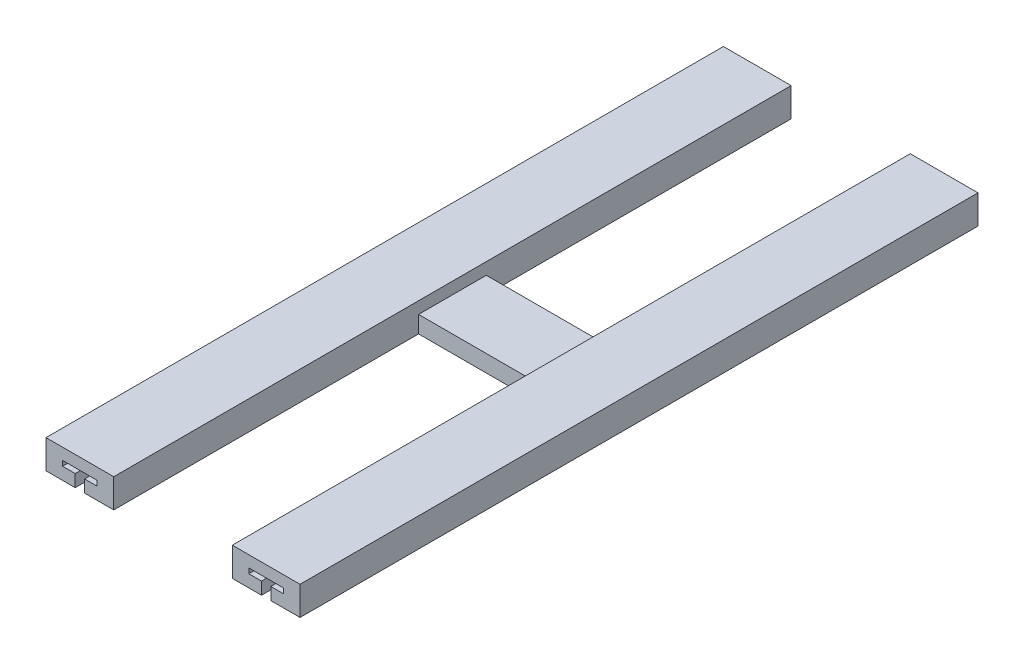
ISO-10303-21;
HEADER;
FILE_DESCRIPTION(('STEP AP214'),'2;1');
FILE_NAME('part.step','',(''),(''),'','','');
FILE_SCHEMA(('AUTOMOTIVE_DESIGN { 1 0 10303 214 1 1 1 1 }'));
ENDSEC;
DATA;
#1=APPLICATION_CONTEXT('core data for automotive mechanical design processes');
#2=APPLICATION_PROTOCOL_DEFINITION('international standard','automotive_design',2000,#1);
#3=PRODUCT_CONTEXT('',#1,'mechanical');
#4=PRODUCT('Part','Part','',(#3));
#5=PRODUCT_RELATED_PRODUCT_CATEGORY('part','',(#4));
#6=PRODUCT_DEFINITION_FORMATION('','',#4);
#7=PRODUCT_DEFINITION_CONTEXT('part definition',#1,'design');
#8=PRODUCT_DEFINITION('design','',#6,#7);
#9=PRODUCT_DEFINITION_SHAPE('','',#8);
#10=(LENGTH_UNIT() NAMED_UNIT(*) SI_UNIT(.MILLI.,.METRE.));
#11=(NAMED_UNIT(*) PLANE_ANGLE_UNIT() SI_UNIT($,.RADIAN.));
#12=(NAMED_UNIT(*) SI_UNIT($,.STERADIAN.) SOLID_ANGLE_UNIT());
#13=UNCERTAINTY_MEASURE_WITH_UNIT(LENGTH_MEASURE(1.E-05),#10,'distance_accuracy_value','');
#14=(GEOMETRIC_REPRESENTATION_CONTEXT(3) GLOBAL_UNCERTAINTY_ASSIGNED_CONTEXT((#13)) GLOBAL_UNIT_ASSIGNED_CONTEXT((#10,
#11,#12)) REPRESENTATION_CONTEXT('',''));
#15=CARTESIAN_POINT('',(0.,0.,0.));
#16=DIRECTION('',(0.,0.,1.));
#17=DIRECTION('',(1.,0.,0.));
#18=AXIS2_PLACEMENT_3D('',#15,#16,#17);
#19=CARTESIAN_POINT('',(0.,0.,0.));
#20=DIRECTION('',(0.,-1.,0.));
#21=DIRECTION('',(0.,0.,-1.));
#22=AXIS2_PLACEMENT_3D('',#19,#20,#21);
#23=PLANE('',#22);
#24=DIRECTION('',(-1.,0.,0.));
#25=VECTOR('',#24,1.);
#26=CARTESIAN_POINT('',(0.,0.,-49.6681439708841));
#27=LINE('',#26,#25);
#28=CARTESIAN_POINT('',(127.25,0.,-49.6681439708841));
#29=VERTEX_POINT('',#28);
#30=CARTESIAN_POINT('',(110.,0.,-49.6681439708841));
#31=VERTEX_POINT('',#30);
#32=EDGE_CURVE('E216',#29,#31,#27,.T.);
#33=ORIENTED_EDGE('',*,*,#32,.T.);
#34=DIRECTION('',(0.,0.,1.));
#35=VECTOR('',#34,1.);
#36=CARTESIAN_POINT('',(110.,0.,-229.668143970884));
#37=LINE('',#36,#35);
#38=CARTESIAN_POINT('',(110.,0.,-229.668143970884));
#39=VERTEX_POINT('',#38);
#40=EDGE_CURVE('E185',#39,#31,#37,.T.);
#41=ORIENTED_EDGE('',*,*,#40,.F.);
#42=DIRECTION('',(1.,0.,0.));
#43=VECTOR('',#42,1.);
#44=CARTESIAN_POINT('',(40.,0.,-229.668143970884));
#45=LINE('',#44,#43);
#46=CARTESIAN_POINT('',(40.,0.,-229.668143970884));
#47=VERTEX_POINT('',#46);
#48=EDGE_CURVE('E182',#47,#39,#45,.T.);
#49=ORIENTED_EDGE('',*,*,#48,.F.);
#50=DIRECTION('',(0.,0.,-1.));
#51=VECTOR('',#50,1.);
#52=CARTESIAN_POINT('',(40.,0.,-229.668143970884));
#53=LINE('',#52,#51);
#54=CARTESIAN_POINT('',(40.0000000000001,0.,-49.6681439708841));
#55=VERTEX_POINT('',#54);
#56=EDGE_CURVE('E173',#55,#47,#53,.T.);
#57=ORIENTED_EDGE('',*,*,#56,.F.);
#58=DIRECTION('',(1.,0.,0.));
#59=VECTOR('',#58,1.);
#60=CARTESIAN_POINT('',(0.,0.,-49.6681439708841));
#61=LINE('',#60,#59);
#62=CARTESIAN_POINT('',(22.75,0.,-49.6681439708841));
#63=VERTEX_POINT('',#62);
#64=EDGE_CURVE('E141',#63,#55,#61,.T.);
#65=ORIENTED_EDGE('',*,*,#64,.F.);
#66=DIRECTION('',(0.,0.,1.));
#67=VECTOR('',#66,1.);
#68=CARTESIAN_POINT('',(22.75,0.,0.));
#69=LINE('',#68,#67);
#70=CARTESIAN_POINT('',(22.75,0.,-449.668143970884));
#71=VERTEX_POINT('',#70);
#72=EDGE_CURVE('E41',#71,#63,#69,.T.);
#73=ORIENTED_EDGE('',*,*,#72,.F.);
#74=DIRECTION('',(-1.,0.,0.));
#75=VECTOR('',#74,1.);
#76=CARTESIAN_POINT('',(0.,0.,-449.668143970884));
#77=LINE('',#76,#75);
#78=CARTESIAN_POINT('',(40.0000000000001,0.,-449.668143970884));
#79=VERTEX_POINT('',#78);
#80=EDGE_CURVE('E177',#79,#71,#77,.T.);
#81=ORIENTED_EDGE('',*,*,#80,.F.);
#82=DIRECTION('',(0.,0.,-1.));
#83=VECTOR('',#82,1.);
#84=CARTESIAN_POINT('',(40.0000000000001,0.,-449.668143970884));
#85=LINE('',#84,#83);
#86=CARTESIAN_POINT('',(40.,0.,-269.668143970884));
#87=VERTEX_POINT('',#86);
#88=EDGE_CURVE('E371',#87,#79,#85,.T.);
#89=ORIENTED_EDGE('',*,*,#88,.F.);
#90=DIRECTION('',(-1.,0.,0.));
#91=VECTOR('',#90,1.);
#92=CARTESIAN_POINT('',(40.,0.,-269.668143970884));
#93=LINE('',#92,#91);
#94=CARTESIAN_POINT('',(110.,0.,-269.668143970884));
#95=VERTEX_POINT('',#94);
#96=EDGE_CURVE('E362',#95,#87,#93,.T.);
#97=ORIENTED_EDGE('',*,*,#96,.F.);
#98=DIRECTION('',(0.,0.,1.));
#99=VECTOR('',#98,1.);
#100=CARTESIAN_POINT('',(110.,0.,-450.));
#101=LINE('',#100,#99);
#102=CARTESIAN_POINT('',(110.,0.,-450.));
#103=VERTEX_POINT('',#102);
#104=EDGE_CURVE('E126',#103,#95,#101,.T.);
#105=ORIENTED_EDGE('',*,*,#104,.F.);
#106=DIRECTION('',(-1.,0.,0.));
#107=VECTOR('',#106,1.);
#108=CARTESIAN_POINT('',(110.,0.,-450.));
#109=LINE('',#108,#107);
#110=CARTESIAN_POINT('',(127.25,0.,-450.));
#111=VERTEX_POINT('',#110);
#112=EDGE_CURVE('E190',#111,#103,#109,.T.);
#113=ORIENTED_EDGE('',*,*,#112,.F.);
#114=DIRECTION('',(0.,0.,1.));
#115=VECTOR('',#114,1.);
#116=CARTESIAN_POINT('',(127.25,0.,-450.));
#117=LINE('',#116,#115);
#118=EDGE_CURVE('E169',#111,#29,#117,.T.);
#119=ORIENTED_EDGE('',*,*,#118,.T.);
#120=EDGE_LOOP('',(#33,#41,#49,#57,#65,#73,#81,#89,#97,#105,#113,#119));
#121=FACE_BOUND('',#120,.T.);
#122=ADVANCED_FACE('F33',(#121),#23,.T.);
#123=CARTESIAN_POINT('',(110.,17.,-450.));
#124=DIRECTION('',(0.,0.,1.));
#125=DIRECTION('',(1.,0.,0.));
#126=AXIS2_PLACEMENT_3D('',#123,#124,#125);
#127=PLANE('',#126);
#128=DIRECTION('',(0.,1.,0.));
#129=VECTOR('',#128,1.);
#130=CARTESIAN_POINT('',(127.25,7.25,-450.));
#131=LINE('',#130,#129);
#132=CARTESIAN_POINT('',(127.25,7.25,-450.));
#133=VERTEX_POINT('',#132);
#134=EDGE_CURVE('E258',#111,#133,#131,.T.);
#135=ORIENTED_EDGE('',*,*,#134,.F.);
#136=ORIENTED_EDGE('',*,*,#112,.T.);
#137=DIRECTION('',(0.,-1.,0.));
#138=VECTOR('',#137,1.);
#139=CARTESIAN_POINT('',(110.,17.,-450.));
#140=LINE('',#139,#138);
#141=CARTESIAN_POINT('',(110.,17.,-450.));
#142=VERTEX_POINT('',#141);
#143=EDGE_CURVE('E196',#142,#103,#140,.T.);
#144=ORIENTED_EDGE('',*,*,#143,.F.);
#145=DIRECTION('',(-1.,0.,0.));
#146=VECTOR('',#145,1.);
#147=CARTESIAN_POINT('',(110.,17.,-450.));
#148=LINE('',#147,#146);
#149=CARTESIAN_POINT('',(150.,17.,-450.));
#150=VERTEX_POINT('',#149);
#151=EDGE_CURVE('E197',#150,#142,#148,.T.);
#152=ORIENTED_EDGE('',*,*,#151,.F.);
#153=DIRECTION('',(0.,-1.,0.));
#154=VECTOR('',#153,1.);
#155=CARTESIAN_POINT('',(150.,17.,-450.));
#156=LINE('',#155,#154);
#157=CARTESIAN_POINT('',(150.,0.,-450.));
#158=VERTEX_POINT('',#157);
#159=EDGE_CURVE('E199',#150,#158,#156,.T.);
#160=ORIENTED_EDGE('',*,*,#159,.T.);
#161=CARTESIAN_POINT('',(132.75,0.,-450.));
#162=VERTEX_POINT('',#161);
#163=EDGE_CURVE('E191',#158,#162,#109,.T.);
#164=ORIENTED_EDGE('',*,*,#163,.T.);
#165=DIRECTION('',(0.,-1.,0.));
#166=VECTOR('',#165,1.);
#167=CARTESIAN_POINT('',(132.75,0.,-450.));
#168=LINE('',#167,#166);
#169=CARTESIAN_POINT('',(132.75,7.25,-450.));
#170=VERTEX_POINT('',#169);
#171=EDGE_CURVE('E239',#170,#162,#168,.T.);
#172=ORIENTED_EDGE('',*,*,#171,.F.);
#173=DIRECTION('',(-1.,0.,0.));
#174=VECTOR('',#173,1.);
#175=CARTESIAN_POINT('',(132.75,7.25,-450.));
#176=LINE('',#175,#174);
#177=CARTESIAN_POINT('',(140.25,7.25,-450.));
#178=VERTEX_POINT('',#177);
#179=EDGE_CURVE('E242',#178,#170,#176,.T.);
#180=ORIENTED_EDGE('',*,*,#179,.F.);
#181=DIRECTION('',(0.,-1.,0.));
#182=VECTOR('',#181,1.);
#183=CARTESIAN_POINT('',(140.25,7.25,-450.));
#184=LINE('',#183,#182);
#185=CARTESIAN_POINT('',(140.25,10.25,-450.));
#186=VERTEX_POINT('',#185);
#187=EDGE_CURVE('E246',#186,#178,#184,.T.);
#188=ORIENTED_EDGE('',*,*,#187,.F.);
#189=DIRECTION('',(1.,0.,0.));
#190=VECTOR('',#189,1.);
#191=CARTESIAN_POINT('',(140.25,10.25,-450.));
#192=LINE('',#191,#190);
#193=CARTESIAN_POINT('',(119.75,10.25,-450.));
#194=VERTEX_POINT('',#193);
#195=EDGE_CURVE('E249',#194,#186,#192,.T.);
#196=ORIENTED_EDGE('',*,*,#195,.F.);
#197=DIRECTION('',(0.,1.,0.));
#198=VECTOR('',#197,1.);
#199=CARTESIAN_POINT('',(119.75,10.25,-450.));
#200=LINE('',#199,#198);
#201=CARTESIAN_POINT('',(119.75,7.25,-450.));
#202=VERTEX_POINT('',#201);
#203=EDGE_CURVE('E252',#202,#194,#200,.T.);
#204=ORIENTED_EDGE('',*,*,#203,.F.);
#205=DIRECTION('',(-1.,0.,0.));
#206=VECTOR('',#205,1.);
#207=CARTESIAN_POINT('',(119.75,7.25,-450.));
#208=LINE('',#207,#206);
#209=EDGE_CURVE('E255',#133,#202,#208,.T.);
#210=ORIENTED_EDGE('',*,*,#209,.F.);
#211=EDGE_LOOP('',(#135,#136,#144,#152,#160,#164,#172,#180,#188,#196,#204,#210));
#212=FACE_BOUND('',#211,.T.);
#213=ADVANCED_FACE('F428',(#212),#127,.F.);
#214=CARTESIAN_POINT('',(150.,0.,-49.6681439708841));
#215=VERTEX_POINT('',#214);
#216=CARTESIAN_POINT('',(132.75,0.,-49.6681439708841));
#217=VERTEX_POINT('',#216);
#218=EDGE_CURVE('E226',#215,#217,#27,.T.);
#219=ORIENTED_EDGE('',*,*,#218,.T.);
#220=DIRECTION('',(0.,0.,1.));
#221=VECTOR('',#220,1.);
#222=CARTESIAN_POINT('',(132.75,0.,-450.));
#223=LINE('',#222,#221);
#224=EDGE_CURVE('E261',#162,#217,#223,.T.);
#225=ORIENTED_EDGE('',*,*,#224,.F.);
#226=ORIENTED_EDGE('',*,*,#163,.F.);
#227=DIRECTION('',(0.,0.,-1.));
#228=VECTOR('',#227,1.);
#229=CARTESIAN_POINT('',(150.,0.,-10.));
#230=LINE('',#229,#228);
#231=EDGE_CURVE('E188',#215,#158,#230,.T.);
#232=ORIENTED_EDGE('',*,*,#231,.F.);
#233=EDGE_LOOP('',(#219,#225,#226,#232));
#234=FACE_BOUND('',#233,.T.);
#235=ADVANCED_FACE('F504',(#234),#23,.T.);
#236=DIRECTION('',(0.,0.,-1.));
#237=VECTOR('',#236,1.);
#238=CARTESIAN_POINT('',(17.25,0.,0.));
#239=LINE('',#238,#237);
#240=CARTESIAN_POINT('',(17.25,0.,-49.6681439708841));
#241=VERTEX_POINT('',#240);
#242=CARTESIAN_POINT('',(17.25,0.,-449.668143970884));
#243=VERTEX_POINT('',#242);
#244=EDGE_CURVE('E11',#241,#243,#239,.T.);
#245=ORIENTED_EDGE('',*,*,#244,.F.);
#246=CARTESIAN_POINT('',(0.,0.,-49.6681439708841));
#247=VERTEX_POINT('',#246);
#248=EDGE_CURVE('E174',#247,#241,#61,.T.);
#249=ORIENTED_EDGE('',*,*,#248,.F.);
#250=DIRECTION('',(0.,0.,1.));
#251=VECTOR('',#250,1.);
#252=CARTESIAN_POINT('',(0.,0.,-49.6681439708841));
#253=LINE('',#252,#251);
#254=CARTESIAN_POINT('',(0.,0.,-449.668143970884));
#255=VERTEX_POINT('',#254);
#256=EDGE_CURVE('E175',#255,#247,#253,.T.);
#257=ORIENTED_EDGE('',*,*,#256,.F.);
#258=EDGE_CURVE('E372',#243,#255,#77,.T.);
#259=ORIENTED_EDGE('',*,*,#258,.F.);
#260=EDGE_LOOP('',(#245,#249,#257,#259));
#261=FACE_BOUND('',#260,.T.);
#262=ADVANCED_FACE('F385',(#261),#23,.T.);
#263=CARTESIAN_POINT('',(40.,17.,-269.668143970884));
#264=DIRECTION('',(0.,0.,1.));
#265=DIRECTION('',(1.,0.,0.));
#266=AXIS2_PLACEMENT_3D('',#263,#264,#265);
#267=PLANE('',#266);
#268=DIRECTION('',(-1.,0.,0.));
#269=VECTOR('',#268,1.);
#270=CARTESIAN_POINT('',(40.,10.,-269.668143970884));
#271=LINE('',#270,#269);
#272=CARTESIAN_POINT('',(110.,10.,-269.668143970884));
#273=VERTEX_POINT('',#272);
#274=CARTESIAN_POINT('',(40.,10.,-269.668143970884));
#275=VERTEX_POINT('',#274);
#276=EDGE_CURVE('E360',#273,#275,#271,.T.);
#277=ORIENTED_EDGE('',*,*,#276,.F.);
#278=DIRECTION('',(0.,-1.,0.));
#279=VECTOR('',#278,1.);
#280=CARTESIAN_POINT('',(110.,17.,-269.668143970884));
#281=LINE('',#280,#279);
#282=EDGE_CURVE('E98',#273,#95,#281,.T.);
#283=ORIENTED_EDGE('',*,*,#282,.T.);
#284=ORIENTED_EDGE('',*,*,#96,.T.);
#285=DIRECTION('',(0.,-1.,0.));
#286=VECTOR('',#285,1.);
#287=CARTESIAN_POINT('',(40.,17.,-269.668143970884));
#288=LINE('',#287,#286);
#289=EDGE_CURVE('E154',#275,#87,#288,.T.);
#290=ORIENTED_EDGE('',*,*,#289,.F.);
#291=EDGE_LOOP('',(#277,#283,#284,#290));
#292=FACE_BOUND('',#291,.T.);
#293=ADVANCED_FACE('F35',(#292),#267,.F.);
#294=CARTESIAN_POINT('',(40.,17.,-229.668143970884));
#295=DIRECTION('',(0.,0.,-1.));
#296=DIRECTION('',(-1.,0.,0.));
#297=AXIS2_PLACEMENT_3D('',#294,#295,#296);
#298=PLANE('',#297);
#299=DIRECTION('',(1.,0.,0.));
#300=VECTOR('',#299,1.);
#301=CARTESIAN_POINT('',(40.,10.,-229.668143970884));
#302=LINE('',#301,#300);
#303=CARTESIAN_POINT('',(40.,10.,-229.668143970884));
#304=VERTEX_POINT('',#303);
#305=CARTESIAN_POINT('',(110.,10.,-229.668143970884));
#306=VERTEX_POINT('',#305);
#307=EDGE_CURVE('E357',#304,#306,#302,.T.);
#308=ORIENTED_EDGE('',*,*,#307,.F.);
#309=DIRECTION('',(0.,-1.,0.));
#310=VECTOR('',#309,1.);
#311=CARTESIAN_POINT('',(40.,17.,-229.668143970884));
#312=LINE('',#311,#310);
#313=EDGE_CURVE('E143',#304,#47,#312,.T.);
#314=ORIENTED_EDGE('',*,*,#313,.T.);
#315=ORIENTED_EDGE('',*,*,#48,.T.);
#316=DIRECTION('',(0.,-1.,0.));
#317=VECTOR('',#316,1.);
#318=CARTESIAN_POINT('',(110.,17.,-229.668143970884));
#319=LINE('',#318,#317);
#320=EDGE_CURVE('E147',#306,#39,#319,.T.);
#321=ORIENTED_EDGE('',*,*,#320,.F.);
#322=EDGE_LOOP('',(#308,#314,#315,#321));
#323=FACE_BOUND('',#322,.T.);
#324=ADVANCED_FACE('F212',(#323),#298,.F.);
#325=CARTESIAN_POINT('',(0.,17.,0.));
#326=DIRECTION('',(0.,-1.,0.));
#327=DIRECTION('',(0.,0.,-1.));
#328=AXIS2_PLACEMENT_3D('',#325,#326,#327);
#329=PLANE('',#328);
#330=DIRECTION('',(1.,0.,0.));
#331=VECTOR('',#330,1.);
#332=CARTESIAN_POINT('',(0.,17.,-49.6681439708841));
#333=LINE('',#332,#331);
#334=CARTESIAN_POINT('',(0.,17.,-49.6681439708841));
#335=VERTEX_POINT('',#334);
#336=CARTESIAN_POINT('',(40.0000000000001,17.,-49.6681439708841));
#337=VERTEX_POINT('',#336);
#338=EDGE_CURVE('E129',#335,#337,#333,.T.);
#339=ORIENTED_EDGE('',*,*,#338,.T.);
#340=DIRECTION('',(0.,0.,-1.));
#341=VECTOR('',#340,1.);
#342=CARTESIAN_POINT('',(40.0000000000001,17.,-449.668143970884));
#343=LINE('',#342,#341);
#344=CARTESIAN_POINT('',(40.0000000000001,17.,-449.668143970884));
#345=VERTEX_POINT('',#344);
#346=EDGE_CURVE('E107',#337,#345,#343,.T.);
#347=ORIENTED_EDGE('',*,*,#346,.T.);
#348=DIRECTION('',(-1.,0.,0.));
#349=VECTOR('',#348,1.);
#350=CARTESIAN_POINT('',(0.,17.,-449.668143970884));
#351=LINE('',#350,#349);
#352=CARTESIAN_POINT('',(0.,17.,-449.668143970884));
#353=VERTEX_POINT('',#352);
#354=EDGE_CURVE('E125',#345,#353,#351,.T.);
#355=ORIENTED_EDGE('',*,*,#354,.T.);
#356=DIRECTION('',(0.,0.,1.));
#357=VECTOR('',#356,1.);
#358=CARTESIAN_POINT('',(0.,17.,-49.6681439708841));
#359=LINE('',#358,#357);
#360=EDGE_CURVE('E132',#353,#335,#359,.T.);
#361=ORIENTED_EDGE('',*,*,#360,.T.);
#362=EDGE_LOOP('',(#339,#347,#355,#361));
#363=FACE_BOUND('',#362,.T.);
#364=ADVANCED_FACE('F130',(#363),#329,.F.);
#365=CARTESIAN_POINT('',(0.,17.,-449.668143970884));
#366=DIRECTION('',(0.,0.,1.));
#367=DIRECTION('',(1.,0.,0.));
#368=AXIS2_PLACEMENT_3D('',#365,#366,#367);
#369=PLANE('',#368);
#370=DIRECTION('',(1.,0.,0.));
#371=VECTOR('',#370,1.);
#372=CARTESIAN_POINT('',(0.,7.25,-449.668143970884));
#373=LINE('',#372,#371);
#374=CARTESIAN_POINT('',(9.75000000000003,7.25,-449.668143970884));
#375=VERTEX_POINT('',#374);
#376=CARTESIAN_POINT('',(17.25,7.25,-449.668143970884));
#377=VERTEX_POINT('',#376);
#378=EDGE_CURVE('E351',#375,#377,#373,.T.);
#379=ORIENTED_EDGE('',*,*,#378,.T.);
#380=DIRECTION('',(0.,-1.,0.));
#381=VECTOR('',#380,1.);
#382=CARTESIAN_POINT('',(17.25,17.,-449.668143970884));
#383=LINE('',#382,#381);
#384=EDGE_CURVE('E336',#377,#243,#383,.T.);
#385=ORIENTED_EDGE('',*,*,#384,.T.);
#386=ORIENTED_EDGE('',*,*,#258,.T.);
#387=DIRECTION('',(0.,-1.,0.));
#388=VECTOR('',#387,1.);
#389=CARTESIAN_POINT('',(0.,17.,-449.668143970884));
#390=LINE('',#389,#388);
#391=EDGE_CURVE('E145',#353,#255,#390,.T.);
#392=ORIENTED_EDGE('',*,*,#391,.F.);
#393=ORIENTED_EDGE('',*,*,#354,.F.);
#394=DIRECTION('',(0.,-1.,0.));
#395=VECTOR('',#394,1.);
#396=CARTESIAN_POINT('',(40.0000000000001,17.,-449.668143970884));
#397=LINE('',#396,#395);
#398=EDGE_CURVE('E123',#345,#79,#397,.T.);
#399=ORIENTED_EDGE('',*,*,#398,.T.);
#400=ORIENTED_EDGE('',*,*,#80,.T.);
#401=DIRECTION('',(0.,1.,0.));
#402=VECTOR('',#401,1.);
#403=CARTESIAN_POINT('',(22.75,17.,-449.668143970884));
#404=LINE('',#403,#402);
#405=CARTESIAN_POINT('',(22.75,7.25,-449.668143970884));
#406=VERTEX_POINT('',#405);
#407=EDGE_CURVE('E48',#71,#406,#404,.T.);
#408=ORIENTED_EDGE('',*,*,#407,.T.);
#409=DIRECTION('',(1.,0.,0.));
#410=VECTOR('',#409,1.);
#411=CARTESIAN_POINT('',(0.,7.24999999999999,-449.668143970884));
#412=LINE('',#411,#410);
#413=CARTESIAN_POINT('',(30.25,7.25,-449.668143970884));
#414=VERTEX_POINT('',#413);
#415=EDGE_CURVE('E339',#406,#414,#412,.T.);
#416=ORIENTED_EDGE('',*,*,#415,.T.);
#417=DIRECTION('',(0.,1.,0.));
#418=VECTOR('',#417,1.);
#419=CARTESIAN_POINT('',(30.25,17.,-449.668143970884));
#420=LINE('',#419,#418);
#421=CARTESIAN_POINT('',(30.25,10.25,-449.668143970884));
#422=VERTEX_POINT('',#421);
#423=EDGE_CURVE('E342',#414,#422,#420,.T.);
#424=ORIENTED_EDGE('',*,*,#423,.T.);
#425=DIRECTION('',(-1.,0.,0.));
#426=VECTOR('',#425,1.);
#427=CARTESIAN_POINT('',(0.,10.25,-449.668143970884));
#428=LINE('',#427,#426);
#429=CARTESIAN_POINT('',(9.75000000000003,10.25,-449.668143970884));
#430=VERTEX_POINT('',#429);
#431=EDGE_CURVE('E345',#422,#430,#428,.T.);
#432=ORIENTED_EDGE('',*,*,#431,.T.);
#433=DIRECTION('',(0.,-1.,0.));
#434=VECTOR('',#433,1.);
#435=CARTESIAN_POINT('',(9.75000000000002,17.,-449.668143970884));
#436=LINE('',#435,#434);
#437=EDGE_CURVE('E348',#430,#375,#436,.T.);
#438=ORIENTED_EDGE('',*,*,#437,.T.);
#439=EDGE_LOOP('',(#379,#385,#386,#392,#393,#399,#400,#408,#416,#424,#432,#438));
#440=FACE_BOUND('',#439,.T.);
#441=ADVANCED_FACE('F376',(#440),#369,.F.);
#442=CARTESIAN_POINT('',(0.,17.,-49.6681439708841));
#443=DIRECTION('',(1.,0.,0.));
#444=DIRECTION('',(0.,0.,-1.));
#445=AXIS2_PLACEMENT_3D('',#442,#443,#444);
#446=PLANE('',#445);
#447=ORIENTED_EDGE('',*,*,#256,.T.);
#448=DIRECTION('',(0.,-1.,0.));
#449=VECTOR('',#448,1.);
#450=CARTESIAN_POINT('',(0.,17.,-49.6681439708841));
#451=LINE('',#450,#449);
#452=EDGE_CURVE('E142',#335,#247,#451,.T.);
#453=ORIENTED_EDGE('',*,*,#452,.F.);
#454=ORIENTED_EDGE('',*,*,#360,.F.);
#455=ORIENTED_EDGE('',*,*,#391,.T.);
#456=EDGE_LOOP('',(#447,#453,#454,#455));
#457=FACE_BOUND('',#456,.T.);
#458=ADVANCED_FACE('F383',(#457),#446,.F.);
#459=CARTESIAN_POINT('',(0.,17.,-49.6681439708841));
#460=DIRECTION('',(0.,0.,-1.));
#461=DIRECTION('',(-1.,0.,0.));
#462=AXIS2_PLACEMENT_3D('',#459,#460,#461);
#463=PLANE('',#462);
#464=ORIENTED_EDGE('',*,*,#248,.T.);
#465=DIRECTION('',(0.,-1.,0.));
#466=VECTOR('',#465,1.);
#467=CARTESIAN_POINT('',(17.25,0.,-49.6681439708841));
#468=LINE('',#467,#466);
#469=CARTESIAN_POINT('',(17.25,7.25,-49.6681439708841));
#470=VERTEX_POINT('',#469);
#471=EDGE_CURVE('E314',#470,#241,#468,.T.);
#472=ORIENTED_EDGE('',*,*,#471,.F.);
#473=DIRECTION('',(1.,0.,0.));
#474=VECTOR('',#473,1.);
#475=CARTESIAN_POINT('',(17.25,7.25,-49.6681439708841));
#476=LINE('',#475,#474);
#477=CARTESIAN_POINT('',(9.75000000000003,7.25,-49.6681439708841));
#478=VERTEX_POINT('',#477);
#479=EDGE_CURVE('E311',#478,#470,#476,.T.);
#480=ORIENTED_EDGE('',*,*,#479,.F.);
#481=DIRECTION('',(0.,-1.,0.));
#482=VECTOR('',#481,1.);
#483=CARTESIAN_POINT('',(9.75000000000003,7.25,-49.6681439708841));
#484=LINE('',#483,#482);
#485=CARTESIAN_POINT('',(9.75000000000003,10.25,-49.6681439708841));
#486=VERTEX_POINT('',#485);
#487=EDGE_CURVE('E308',#486,#478,#484,.T.);
#488=ORIENTED_EDGE('',*,*,#487,.F.);
#489=DIRECTION('',(-1.,0.,0.));
#490=VECTOR('',#489,1.);
#491=CARTESIAN_POINT('',(9.75000000000003,10.25,-49.6681439708841));
#492=LINE('',#491,#490);
#493=CARTESIAN_POINT('',(30.25,10.25,-49.6681439708841));
#494=VERTEX_POINT('',#493);
#495=EDGE_CURVE('E305',#494,#486,#492,.T.);
#496=ORIENTED_EDGE('',*,*,#495,.F.);
#497=DIRECTION('',(0.,1.,0.));
#498=VECTOR('',#497,1.);
#499=CARTESIAN_POINT('',(30.25,10.25,-49.6681439708841));
#500=LINE('',#499,#498);
#501=CARTESIAN_POINT('',(30.25,7.25,-49.6681439708841));
#502=VERTEX_POINT('',#501);
#503=EDGE_CURVE('E302',#502,#494,#500,.T.);
#504=ORIENTED_EDGE('',*,*,#503,.F.);
#505=DIRECTION('',(1.,0.,0.));
#506=VECTOR('',#505,1.);
#507=CARTESIAN_POINT('',(30.25,7.25,-49.6681439708841));
#508=LINE('',#507,#506);
#509=CARTESIAN_POINT('',(22.75,7.25,-49.6681439708841));
#510=VERTEX_POINT('',#509);
#511=EDGE_CURVE('E168',#510,#502,#508,.T.);
#512=ORIENTED_EDGE('',*,*,#511,.F.);
#513=DIRECTION('',(0.,1.,0.));
#514=VECTOR('',#513,1.);
#515=CARTESIAN_POINT('',(22.75,7.25,-49.6681439708841));
#516=LINE('',#515,#514);
#517=EDGE_CURVE('E159',#63,#510,#516,.T.);
#518=ORIENTED_EDGE('',*,*,#517,.F.);
#519=ORIENTED_EDGE('',*,*,#64,.T.);
#520=DIRECTION('',(0.,-1.,0.));
#521=VECTOR('',#520,1.);
#522=CARTESIAN_POINT('',(40.0000000000001,17.,-49.6681439708841));
#523=LINE('',#522,#521);
#524=EDGE_CURVE('E120',#337,#55,#523,.T.);
#525=ORIENTED_EDGE('',*,*,#524,.F.);
#526=ORIENTED_EDGE('',*,*,#338,.F.);
#527=ORIENTED_EDGE('',*,*,#452,.T.);
#528=EDGE_LOOP('',(#464,#472,#480,#488,#496,#504,#512,#518,#519,#525,#526,#527));
#529=FACE_BOUND('',#528,.T.);
#530=ADVANCED_FACE('F138',(#529),#463,.F.);
#531=CARTESIAN_POINT('',(40.,17.,-229.668143970884));
#532=DIRECTION('',(-1.,0.,0.));
#533=DIRECTION('',(0.,0.,1.));
#534=AXIS2_PLACEMENT_3D('',#531,#532,#533);
#535=PLANE('',#534);
#536=ORIENTED_EDGE('',*,*,#56,.T.);
#537=ORIENTED_EDGE('',*,*,#313,.F.);
#538=DIRECTION('',(0.,0.,1.));
#539=VECTOR('',#538,1.);
#540=CARTESIAN_POINT('',(40.,10.,-269.668143970884));
#541=LINE('',#540,#539);
#542=EDGE_CURVE('E354',#275,#304,#541,.T.);
#543=ORIENTED_EDGE('',*,*,#542,.F.);
#544=ORIENTED_EDGE('',*,*,#289,.T.);
#545=ORIENTED_EDGE('',*,*,#88,.T.);
#546=ORIENTED_EDGE('',*,*,#398,.F.);
#547=ORIENTED_EDGE('',*,*,#346,.F.);
#548=ORIENTED_EDGE('',*,*,#524,.T.);
#549=EDGE_LOOP('',(#536,#537,#543,#544,#545,#546,#547,#548));
#550=FACE_BOUND('',#549,.T.);
#551=ADVANCED_FACE('F118',(#550),#535,.F.);
#552=CARTESIAN_POINT('',(150.,17.,-10.));
#553=DIRECTION('',(-1.,0.,0.));
#554=DIRECTION('',(0.,0.,1.));
#555=AXIS2_PLACEMENT_3D('',#552,#553,#554);
#556=PLANE('',#555);
#557=DIRECTION('',(0.,0.,-1.));
#558=VECTOR('',#557,1.);
#559=CARTESIAN_POINT('',(150.,17.,-10.));
#560=LINE('',#559,#558);
#561=CARTESIAN_POINT('',(150.,17.,-49.6681439708841));
#562=VERTEX_POINT('',#561);
#563=EDGE_CURVE('E367',#562,#150,#560,.T.);
#564=ORIENTED_EDGE('',*,*,#563,.F.);
#565=DIRECTION('',(0.,1.,0.));
#566=VECTOR('',#565,1.);
#567=CARTESIAN_POINT('',(150.,0.,-49.6681439708841));
#568=LINE('',#567,#566);
#569=EDGE_CURVE('E229',#215,#562,#568,.T.);
#570=ORIENTED_EDGE('',*,*,#569,.F.);
#571=ORIENTED_EDGE('',*,*,#231,.T.);
#572=ORIENTED_EDGE('',*,*,#159,.F.);
#573=EDGE_LOOP('',(#564,#570,#571,#572));
#574=FACE_BOUND('',#573,.T.);
#575=ADVANCED_FACE('F536',(#574),#556,.F.);
#576=CARTESIAN_POINT('',(110.,17.,-450.));
#577=DIRECTION('',(1.,0.,0.));
#578=DIRECTION('',(0.,0.,-1.));
#579=AXIS2_PLACEMENT_3D('',#576,#577,#578);
#580=PLANE('',#579);
#581=ORIENTED_EDGE('',*,*,#40,.T.);
#582=DIRECTION('',(0.,1.,0.));
#583=VECTOR('',#582,1.);
#584=CARTESIAN_POINT('',(110.,17.,-49.6681439708841));
#585=LINE('',#584,#583);
#586=CARTESIAN_POINT('',(110.,17.,-49.6681439708841));
#587=VERTEX_POINT('',#586);
#588=EDGE_CURVE('E236',#31,#587,#585,.T.);
#589=ORIENTED_EDGE('',*,*,#588,.T.);
#590=DIRECTION('',(0.,0.,1.));
#591=VECTOR('',#590,1.);
#592=CARTESIAN_POINT('',(110.,17.,-229.668143970884));
#593=LINE('',#592,#591);
#594=EDGE_CURVE('E57',#142,#587,#593,.T.);
#595=ORIENTED_EDGE('',*,*,#594,.F.);
#596=ORIENTED_EDGE('',*,*,#143,.T.);
#597=ORIENTED_EDGE('',*,*,#104,.T.);
#598=ORIENTED_EDGE('',*,*,#282,.F.);
#599=DIRECTION('',(0.,0.,-1.));
#600=VECTOR('',#599,1.);
#601=CARTESIAN_POINT('',(110.,10.,-269.668143970884));
#602=LINE('',#601,#600);
#603=EDGE_CURVE('E208',#306,#273,#602,.T.);
#604=ORIENTED_EDGE('',*,*,#603,.F.);
#605=ORIENTED_EDGE('',*,*,#320,.T.);
#606=EDGE_LOOP('',(#581,#589,#595,#596,#597,#598,#604,#605));
#607=FACE_BOUND('',#606,.T.);
#608=ADVANCED_FACE('F203',(#607),#580,.F.);
#609=ORIENTED_EDGE('',*,*,#594,.T.);
#610=DIRECTION('',(1.,0.,0.));
#611=VECTOR('',#610,1.);
#612=CARTESIAN_POINT('',(0.,17.,-49.6681439708841));
#613=LINE('',#612,#611);
#614=EDGE_CURVE('E233',#587,#562,#613,.T.);
#615=ORIENTED_EDGE('',*,*,#614,.T.);
#616=ORIENTED_EDGE('',*,*,#563,.T.);
#617=ORIENTED_EDGE('',*,*,#151,.T.);
#618=EDGE_LOOP('',(#609,#615,#616,#617));
#619=FACE_BOUND('',#618,.T.);
#620=ADVANCED_FACE('F541',(#619),#329,.F.);
#621=CARTESIAN_POINT('',(0.,10.,0.));
#622=DIRECTION('',(0.,1.,0.));
#623=DIRECTION('',(0.,0.,1.));
#624=AXIS2_PLACEMENT_3D('',#621,#622,#623);
#625=PLANE('',#624);
#626=ORIENTED_EDGE('',*,*,#542,.T.);
#627=ORIENTED_EDGE('',*,*,#307,.T.);
#628=ORIENTED_EDGE('',*,*,#603,.T.);
#629=ORIENTED_EDGE('',*,*,#276,.T.);
#630=EDGE_LOOP('',(#626,#627,#628,#629));
#631=FACE_BOUND('',#630,.T.);
#632=ADVANCED_FACE('F421',(#631),#625,.T.);
#633=CARTESIAN_POINT('',(17.25,7.25,-450.));
#634=DIRECTION('',(0.,-1.,0.));
#635=DIRECTION('',(1.,0.,0.));
#636=AXIS2_PLACEMENT_3D('',#633,#634,#635);
#637=PLANE('',#636);
#638=DIRECTION('',(0.,0.,1.));
#639=VECTOR('',#638,1.);
#640=CARTESIAN_POINT('',(9.75000000000003,7.25,-450.));
#641=LINE('',#640,#639);
#642=EDGE_CURVE('E321',#375,#478,#641,.T.);
#643=ORIENTED_EDGE('',*,*,#642,.T.);
#644=ORIENTED_EDGE('',*,*,#479,.T.);
#645=DIRECTION('',(0.,0.,1.));
#646=VECTOR('',#645,1.);
#647=CARTESIAN_POINT('',(17.25,7.25,-450.));
#648=LINE('',#647,#646);
#649=EDGE_CURVE('E318',#377,#470,#648,.T.);
#650=ORIENTED_EDGE('',*,*,#649,.F.);
#651=ORIENTED_EDGE('',*,*,#378,.F.);
#652=EDGE_LOOP('',(#643,#644,#650,#651));
#653=FACE_BOUND('',#652,.T.);
#654=ADVANCED_FACE('F477',(#653),#637,.F.);
#655=CARTESIAN_POINT('',(9.75000000000003,7.25,-450.));
#656=DIRECTION('',(-1.,0.,0.));
#657=DIRECTION('',(0.,-1.,0.));
#658=AXIS2_PLACEMENT_3D('',#655,#656,#657);
#659=PLANE('',#658);
#660=DIRECTION('',(0.,0.,1.));
#661=VECTOR('',#660,1.);
#662=CARTESIAN_POINT('',(9.75000000000003,10.25,-450.));
#663=LINE('',#662,#661);
#664=EDGE_CURVE('E324',#430,#486,#663,.T.);
#665=ORIENTED_EDGE('',*,*,#664,.T.);
#666=ORIENTED_EDGE('',*,*,#487,.T.);
#667=ORIENTED_EDGE('',*,*,#642,.F.);
#668=ORIENTED_EDGE('',*,*,#437,.F.);
#669=EDGE_LOOP('',(#665,#666,#667,#668));
#670=FACE_BOUND('',#669,.T.);
#671=ADVANCED_FACE('F481',(#670),#659,.F.);
#672=CARTESIAN_POINT('',(9.75000000000003,10.25,-450.));
#673=DIRECTION('',(0.,1.,0.));
#674=DIRECTION('',(0.,0.,1.));
#675=AXIS2_PLACEMENT_3D('',#672,#673,#674);
#676=PLANE('',#675);
#677=DIRECTION('',(0.,0.,1.));
#678=VECTOR('',#677,1.);
#679=CARTESIAN_POINT('',(30.25,10.25,-450.));
#680=LINE('',#679,#678);
#681=EDGE_CURVE('E327',#422,#494,#680,.T.);
#682=ORIENTED_EDGE('',*,*,#681,.T.);
#683=ORIENTED_EDGE('',*,*,#495,.T.);
#684=ORIENTED_EDGE('',*,*,#664,.F.);
#685=ORIENTED_EDGE('',*,*,#431,.F.);
#686=EDGE_LOOP('',(#682,#683,#684,#685));
#687=FACE_BOUND('',#686,.T.);
#688=ADVANCED_FACE('F485',(#687),#676,.F.);
#689=CARTESIAN_POINT('',(30.25,10.25,-450.));
#690=DIRECTION('',(1.,0.,0.));
#691=DIRECTION('',(0.,1.,0.));
#692=AXIS2_PLACEMENT_3D('',#689,#690,#691);
#693=PLANE('',#692);
#694=DIRECTION('',(0.,0.,1.));
#695=VECTOR('',#694,1.);
#696=CARTESIAN_POINT('',(30.25,7.25,-450.));
#697=LINE('',#696,#695);
#698=EDGE_CURVE('E330',#414,#502,#697,.T.);
#699=ORIENTED_EDGE('',*,*,#698,.T.);
#700=ORIENTED_EDGE('',*,*,#503,.T.);
#701=ORIENTED_EDGE('',*,*,#681,.F.);
#702=ORIENTED_EDGE('',*,*,#423,.F.);
#703=EDGE_LOOP('',(#699,#700,#701,#702));
#704=FACE_BOUND('',#703,.T.);
#705=ADVANCED_FACE('F488',(#704),#693,.F.);
#706=CARTESIAN_POINT('',(30.25,7.25,-450.));
#707=DIRECTION('',(0.,-1.,0.));
#708=DIRECTION('',(1.,0.,0.));
#709=AXIS2_PLACEMENT_3D('',#706,#707,#708);
#710=PLANE('',#709);
#711=DIRECTION('',(0.,0.,1.));
#712=VECTOR('',#711,1.);
#713=CARTESIAN_POINT('',(22.75,7.25,-450.));
#714=LINE('',#713,#712);
#715=EDGE_CURVE('E317',#406,#510,#714,.T.);
#716=ORIENTED_EDGE('',*,*,#715,.T.);
#717=ORIENTED_EDGE('',*,*,#511,.T.);
#718=ORIENTED_EDGE('',*,*,#698,.F.);
#719=ORIENTED_EDGE('',*,*,#415,.F.);
#720=EDGE_LOOP('',(#716,#717,#718,#719));
#721=FACE_BOUND('',#720,.T.);
#722=ADVANCED_FACE('F491',(#721),#710,.F.);
#723=CARTESIAN_POINT('',(17.25,0.,-450.));
#724=DIRECTION('',(-1.,0.,0.));
#725=DIRECTION('',(0.,0.,1.));
#726=AXIS2_PLACEMENT_3D('',#723,#724,#725);
#727=PLANE('',#726);
#728=ORIENTED_EDGE('',*,*,#649,.T.);
#729=ORIENTED_EDGE('',*,*,#471,.T.);
#730=ORIENTED_EDGE('',*,*,#244,.T.);
#731=ORIENTED_EDGE('',*,*,#384,.F.);
#732=EDGE_LOOP('',(#728,#729,#730,#731));
#733=FACE_BOUND('',#732,.T.);
#734=ADVANCED_FACE('F493',(#733),#727,.F.);
#735=CARTESIAN_POINT('',(22.75,7.25,-450.));
#736=DIRECTION('',(1.,0.,0.));
#737=DIRECTION('',(0.,0.,-1.));
#738=AXIS2_PLACEMENT_3D('',#735,#736,#737);
#739=PLANE('',#738);
#740=ORIENTED_EDGE('',*,*,#72,.T.);
#741=ORIENTED_EDGE('',*,*,#517,.T.);
#742=ORIENTED_EDGE('',*,*,#715,.F.);
#743=ORIENTED_EDGE('',*,*,#407,.F.);
#744=EDGE_LOOP('',(#740,#741,#742,#743));
#745=FACE_BOUND('',#744,.T.);
#746=ADVANCED_FACE('F157',(#745),#739,.F.);
#747=CARTESIAN_POINT('',(127.25,7.25,-450.));
#748=DIRECTION('',(1.,0.,0.));
#749=DIRECTION('',(0.,0.,-1.));
#750=AXIS2_PLACEMENT_3D('',#747,#748,#749);
#751=PLANE('',#750);
#752=DIRECTION('',(0.,1.,0.));
#753=VECTOR('',#752,1.);
#754=CARTESIAN_POINT('',(127.25,7.25,-49.6681439708841));
#755=LINE('',#754,#753);
#756=CARTESIAN_POINT('',(127.25,7.25,-49.6681439708841));
#757=VERTEX_POINT('',#756);
#758=EDGE_CURVE('E243',#29,#757,#755,.T.);
#759=ORIENTED_EDGE('',*,*,#758,.F.);
#760=ORIENTED_EDGE('',*,*,#118,.F.);
#761=ORIENTED_EDGE('',*,*,#134,.T.);
#762=DIRECTION('',(0.,0.,1.));
#763=VECTOR('',#762,1.);
#764=CARTESIAN_POINT('',(127.25,7.25,-450.));
#765=LINE('',#764,#763);
#766=EDGE_CURVE('E281',#133,#757,#765,.T.);
#767=ORIENTED_EDGE('',*,*,#766,.T.);
#768=EDGE_LOOP('',(#759,#760,#761,#767));
#769=FACE_BOUND('',#768,.T.);
#770=ADVANCED_FACE('F435',(#769),#751,.T.);
#771=CARTESIAN_POINT('',(119.75,7.25,-450.));
#772=DIRECTION('',(0.,1.,0.));
#773=DIRECTION('',(-1.,0.,0.));
#774=AXIS2_PLACEMENT_3D('',#771,#772,#773);
#775=PLANE('',#774);
#776=DIRECTION('',(-1.,0.,0.));
#777=VECTOR('',#776,1.);
#778=CARTESIAN_POINT('',(119.75,7.25,-49.6681439708841));
#779=LINE('',#778,#777);
#780=CARTESIAN_POINT('',(119.75,7.25,-49.6681439708841));
#781=VERTEX_POINT('',#780);
#782=EDGE_CURVE('E276',#757,#781,#779,.T.);
#783=ORIENTED_EDGE('',*,*,#782,.F.);
#784=ORIENTED_EDGE('',*,*,#766,.F.);
#785=ORIENTED_EDGE('',*,*,#209,.T.);
#786=DIRECTION('',(0.,0.,1.));
#787=VECTOR('',#786,1.);
#788=CARTESIAN_POINT('',(119.75,7.25,-450.));
#789=LINE('',#788,#787);
#790=EDGE_CURVE('E284',#202,#781,#789,.T.);
#791=ORIENTED_EDGE('',*,*,#790,.T.);
#792=EDGE_LOOP('',(#783,#784,#785,#791));
#793=FACE_BOUND('',#792,.T.);
#794=ADVANCED_FACE('F441',(#793),#775,.T.);
#795=CARTESIAN_POINT('',(119.75,10.25,-450.));
#796=DIRECTION('',(1.,0.,0.));
#797=DIRECTION('',(0.,1.,0.));
#798=AXIS2_PLACEMENT_3D('',#795,#796,#797);
#799=PLANE('',#798);
#800=DIRECTION('',(0.,1.,0.));
#801=VECTOR('',#800,1.);
#802=CARTESIAN_POINT('',(119.75,10.25,-49.6681439708841));
#803=LINE('',#802,#801);
#804=CARTESIAN_POINT('',(119.75,10.25,-49.6681439708841));
#805=VERTEX_POINT('',#804);
#806=EDGE_CURVE('E273',#781,#805,#803,.T.);
#807=ORIENTED_EDGE('',*,*,#806,.F.);
#808=ORIENTED_EDGE('',*,*,#790,.F.);
#809=ORIENTED_EDGE('',*,*,#203,.T.);
#810=DIRECTION('',(0.,0.,1.));
#811=VECTOR('',#810,1.);
#812=CARTESIAN_POINT('',(119.75,10.25,-450.));
#813=LINE('',#812,#811);
#814=EDGE_CURVE('E287',#194,#805,#813,.T.);
#815=ORIENTED_EDGE('',*,*,#814,.T.);
#816=EDGE_LOOP('',(#807,#808,#809,#815));
#817=FACE_BOUND('',#816,.T.);
#818=ADVANCED_FACE('F723',(#817),#799,.T.);
#819=CARTESIAN_POINT('',(140.25,10.25,-450.));
#820=DIRECTION('',(0.,-1.,0.));
#821=DIRECTION('',(0.,0.,-1.));
#822=AXIS2_PLACEMENT_3D('',#819,#820,#821);
#823=PLANE('',#822);
#824=DIRECTION('',(1.,0.,0.));
#825=VECTOR('',#824,1.);
#826=CARTESIAN_POINT('',(140.25,10.25,-49.6681439708841));
#827=LINE('',#826,#825);
#828=CARTESIAN_POINT('',(140.25,10.25,-49.6681439708841));
#829=VERTEX_POINT('',#828);
#830=EDGE_CURVE('E270',#805,#829,#827,.T.);
#831=ORIENTED_EDGE('',*,*,#830,.F.);
#832=ORIENTED_EDGE('',*,*,#814,.F.);
#833=ORIENTED_EDGE('',*,*,#195,.T.);
#834=DIRECTION('',(0.,0.,1.));
#835=VECTOR('',#834,1.);
#836=CARTESIAN_POINT('',(140.25,10.25,-450.));
#837=LINE('',#836,#835);
#838=EDGE_CURVE('E290',#186,#829,#837,.T.);
#839=ORIENTED_EDGE('',*,*,#838,.T.);
#840=EDGE_LOOP('',(#831,#832,#833,#839));
#841=FACE_BOUND('',#840,.T.);
#842=ADVANCED_FACE('F731',(#841),#823,.T.);
#843=CARTESIAN_POINT('',(140.25,7.25,-450.));
#844=DIRECTION('',(-1.,0.,0.));
#845=DIRECTION('',(0.,-1.,0.));
#846=AXIS2_PLACEMENT_3D('',#843,#844,#845);
#847=PLANE('',#846);
#848=DIRECTION('',(0.,-1.,0.));
#849=VECTOR('',#848,1.);
#850=CARTESIAN_POINT('',(140.25,7.25,-49.6681439708841));
#851=LINE('',#850,#849);
#852=CARTESIAN_POINT('',(140.25,7.25,-49.6681439708841));
#853=VERTEX_POINT('',#852);
#854=EDGE_CURVE('E267',#829,#853,#851,.T.);
#855=ORIENTED_EDGE('',*,*,#854,.F.);
#856=ORIENTED_EDGE('',*,*,#838,.F.);
#857=ORIENTED_EDGE('',*,*,#187,.T.);
#858=DIRECTION('',(0.,0.,1.));
#859=VECTOR('',#858,1.);
#860=CARTESIAN_POINT('',(140.25,7.25,-450.));
#861=LINE('',#860,#859);
#862=EDGE_CURVE('E293',#178,#853,#861,.T.);
#863=ORIENTED_EDGE('',*,*,#862,.T.);
#864=EDGE_LOOP('',(#855,#856,#857,#863));
#865=FACE_BOUND('',#864,.T.);
#866=ADVANCED_FACE('F740',(#865),#847,.T.);
#867=CARTESIAN_POINT('',(132.75,7.25,-450.));
#868=DIRECTION('',(0.,1.,0.));
#869=DIRECTION('',(-1.,0.,0.));
#870=AXIS2_PLACEMENT_3D('',#867,#868,#869);
#871=PLANE('',#870);
#872=DIRECTION('',(-1.,0.,0.));
#873=VECTOR('',#872,1.);
#874=CARTESIAN_POINT('',(132.75,7.25,-49.6681439708841));
#875=LINE('',#874,#873);
#876=CARTESIAN_POINT('',(132.75,7.25,-49.6681439708841));
#877=VERTEX_POINT('',#876);
#878=EDGE_CURVE('E264',#853,#877,#875,.T.);
#879=ORIENTED_EDGE('',*,*,#878,.F.);
#880=ORIENTED_EDGE('',*,*,#862,.F.);
#881=ORIENTED_EDGE('',*,*,#179,.T.);
#882=DIRECTION('',(0.,0.,1.));
#883=VECTOR('',#882,1.);
#884=CARTESIAN_POINT('',(132.75,7.25,-450.));
#885=LINE('',#884,#883);
#886=EDGE_CURVE('E296',#170,#877,#885,.T.);
#887=ORIENTED_EDGE('',*,*,#886,.T.);
#888=EDGE_LOOP('',(#879,#880,#881,#887));
#889=FACE_BOUND('',#888,.T.);
#890=ADVANCED_FACE('F749',(#889),#871,.T.);
#891=CARTESIAN_POINT('',(132.75,0.,-450.));
#892=DIRECTION('',(-1.,0.,0.));
#893=DIRECTION('',(0.,0.,1.));
#894=AXIS2_PLACEMENT_3D('',#891,#892,#893);
#895=PLANE('',#894);
#896=DIRECTION('',(0.,-1.,0.));
#897=VECTOR('',#896,1.);
#898=CARTESIAN_POINT('',(132.75,0.,-49.6681439708841));
#899=LINE('',#898,#897);
#900=EDGE_CURVE('E238',#877,#217,#899,.T.);
#901=ORIENTED_EDGE('',*,*,#900,.F.);
#902=ORIENTED_EDGE('',*,*,#886,.F.);
#903=ORIENTED_EDGE('',*,*,#171,.T.);
#904=ORIENTED_EDGE('',*,*,#224,.T.);
#905=EDGE_LOOP('',(#901,#902,#903,#904));
#906=FACE_BOUND('',#905,.T.);
#907=ADVANCED_FACE('F528',(#906),#895,.T.);
#908=CARTESIAN_POINT('',(0.,0.,-49.6681439708841));
#909=DIRECTION('',(0.,0.,-1.));
#910=DIRECTION('',(-1.,0.,0.));
#911=AXIS2_PLACEMENT_3D('',#908,#909,#910);
#912=PLANE('',#911);
#913=ORIENTED_EDGE('',*,*,#32,.F.);
#914=ORIENTED_EDGE('',*,*,#758,.T.);
#915=ORIENTED_EDGE('',*,*,#782,.T.);
#916=ORIENTED_EDGE('',*,*,#806,.T.);
#917=ORIENTED_EDGE('',*,*,#830,.T.);
#918=ORIENTED_EDGE('',*,*,#854,.T.);
#919=ORIENTED_EDGE('',*,*,#878,.T.);
#920=ORIENTED_EDGE('',*,*,#900,.T.);
#921=ORIENTED_EDGE('',*,*,#218,.F.);
#922=ORIENTED_EDGE('',*,*,#569,.T.);
#923=ORIENTED_EDGE('',*,*,#614,.F.);
#924=ORIENTED_EDGE('',*,*,#588,.F.);
#925=EDGE_LOOP('',(#913,#914,#915,#916,#917,#918,#919,#920,#921,#922,#923,#924));
#926=FACE_BOUND('',#925,.T.);
#927=ADVANCED_FACE('F447',(#926),#912,.F.);
#928=CLOSED_SHELL('',(#122,#213,#235,#262,#293,#324,#364,#441,#458,#530,#551,#575,#608,#620,
#632,#654,#671,#688,#705,#722,#734,#746,#770,#794,#818,#842,#866,#890,#907,#927));
#929=MANIFOLD_SOLID_BREP('B2',#928);
#930=ADVANCED_BREP_SHAPE_REPRESENTATION('',(#18,#929),#14);
#931=SHAPE_DEFINITION_REPRESENTATION(#9,#930);
ENDSEC;
END-ISO-10303-21;
